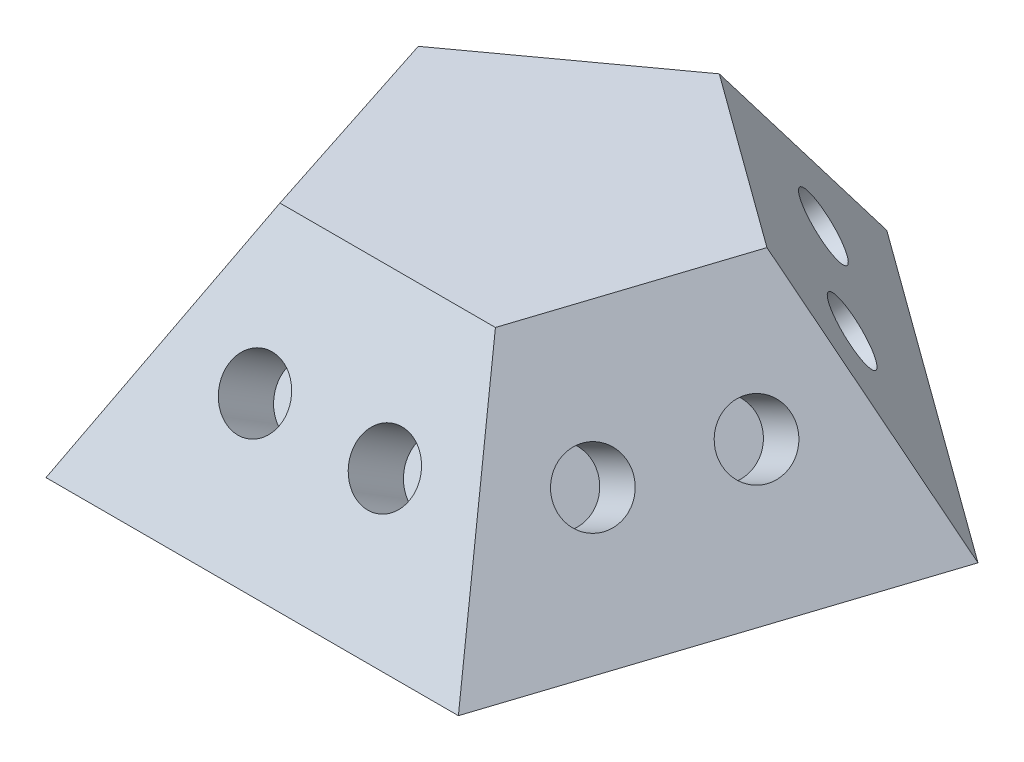
ISO-10303-21;
HEADER;
FILE_DESCRIPTION(('STEP AP214'),'2;1');
FILE_NAME('part.step','',(''),(''),'','','');
FILE_SCHEMA(('AUTOMOTIVE_DESIGN { 1 0 10303 214 1 1 1 1 }'));
ENDSEC;
DATA;
#1=APPLICATION_CONTEXT('core data for automotive mechanical design processes');
#2=APPLICATION_PROTOCOL_DEFINITION('international standard','automotive_design',2000,#1);
#3=PRODUCT_CONTEXT('',#1,'mechanical');
#4=PRODUCT('Part','Part','',(#3));
#5=PRODUCT_RELATED_PRODUCT_CATEGORY('part','',(#4));
#6=PRODUCT_DEFINITION_FORMATION('','',#4);
#7=PRODUCT_DEFINITION_CONTEXT('part definition',#1,'design');
#8=PRODUCT_DEFINITION('design','',#6,#7);
#9=PRODUCT_DEFINITION_SHAPE('','',#8);
#10=(LENGTH_UNIT() NAMED_UNIT(*) SI_UNIT(.MILLI.,.METRE.));
#11=(NAMED_UNIT(*) PLANE_ANGLE_UNIT() SI_UNIT($,.RADIAN.));
#12=(NAMED_UNIT(*) SI_UNIT($,.STERADIAN.) SOLID_ANGLE_UNIT());
#13=UNCERTAINTY_MEASURE_WITH_UNIT(LENGTH_MEASURE(1.E-05),#10,'distance_accuracy_value','');
#14=(GEOMETRIC_REPRESENTATION_CONTEXT(3) GLOBAL_UNCERTAINTY_ASSIGNED_CONTEXT((#13)) GLOBAL_UNIT_ASSIGNED_CONTEXT((#10,
#11,#12)) REPRESENTATION_CONTEXT('',''));
#15=CARTESIAN_POINT('',(0.,0.,0.));
#16=DIRECTION('',(0.,0.,1.));
#17=DIRECTION('',(1.,0.,0.));
#18=AXIS2_PLACEMENT_3D('',#15,#16,#17);
#19=CARTESIAN_POINT('',(10.2745158285618,0.,-3.33839256195651));
#20=DIRECTION('',(0.499999999999999,0.525731112119135,-0.688190960235587));
#21=DIRECTION('',(0.,0.794654472291766,0.607061998206687));
#22=AXIS2_PLACEMENT_3D('',#19,#20,#21);
#23=PLANE('',#22);
#24=CARTESIAN_POINT('',(5.52888070660527,3.37602039564716,-4.20724821160514));
#25=DIRECTION('',(0.500000000000004,0.525731112119135,-0.688190960235583));
#26=DIRECTION('',(0.309016994374952,-0.850650808352039,-0.425325404176018));
#27=AXIS2_PLACEMENT_3D('',#24,#25,#26);
#28=CIRCLE('',#27,1.);
#29=CARTESIAN_POINT('',(5.83789770098022,2.52536958729512,-4.63257361578116));
#30=VERTEX_POINT('',#29);
#31=EDGE_CURVE('E253',#30,#30,#28,.T.);
#32=ORIENTED_EDGE('',*,*,#31,.F.);
#33=EDGE_LOOP('',(#32));
#34=FACE_BOUND('',#33,.T.);
#35=CARTESIAN_POINT('',(2.2928127291055,3.37602039564715,-6.55838922077506));
#36=DIRECTION('',(0.500000000000004,0.525731112119135,-0.688190960235583));
#37=DIRECTION('',(0.309016994374952,-0.850650808352039,-0.425325404176018));
#38=AXIS2_PLACEMENT_3D('',#35,#36,#37);
#39=CIRCLE('',#38,1.);
#40=CARTESIAN_POINT('',(2.60182972348045,2.52536958729511,-6.98371462495108));
#41=VERTEX_POINT('',#40);
#42=EDGE_CURVE('E254',#41,#41,#39,.T.);
#43=ORIENTED_EDGE('',*,*,#42,.F.);
#44=EDGE_LOOP('',(#43));
#45=FACE_BOUND('',#44,.T.);
#46=DIRECTION('',(-0.809016994374948,0.,-0.587785252292472));
#47=VECTOR('',#46,1.);
#48=CARTESIAN_POINT('',(10.2745158285618,0.,-3.33839256195651));
#49=LINE('',#48,#47);
#50=CARTESIAN_POINT('',(10.2745158285618,0.,-3.33839256195651));
#51=VERTEX_POINT('',#50);
#52=CARTESIAN_POINT('',(0.,0.,-10.8032652660709));
#53=VERTEX_POINT('',#52);
#54=EDGE_CURVE('E85',#51,#53,#49,.T.);
#55=ORIENTED_EDGE('',*,*,#54,.T.);
#56=DIRECTION('',(0.,-0.794654472291765,-0.607061998206687));
#57=VECTOR('',#56,1.);
#58=CARTESIAN_POINT('',(0.,0.,-10.8032652660709));
#59=LINE('',#58,#57);
#60=CARTESIAN_POINT('',(0.,6.7520407912943,-5.64516508837352));
#61=VERTEX_POINT('',#60);
#62=EDGE_CURVE('E11',#61,#53,#59,.T.);
#63=ORIENTED_EDGE('',*,*,#62,.F.);
#64=DIRECTION('',(0.809016994374948,0.,0.587785252292472));
#65=VECTOR('',#64,1.);
#66=CARTESIAN_POINT('',(7.82169343571069,6.7520407912943,0.0376278336906518));
#67=LINE('',#66,#65);
#68=CARTESIAN_POINT('',(5.36887104285954,6.7520407912943,-1.74445194835958));
#69=VERTEX_POINT('',#68);
#70=EDGE_CURVE('E111',#69,#61,#67,.F.);
#71=ORIENTED_EDGE('',*,*,#70,.F.);
#72=DIRECTION('',(0.577350269189626,-0.794654472291765,-0.187592474085081));
#73=VECTOR('',#72,1.);
#74=CARTESIAN_POINT('',(10.2745158285618,0.,-3.33839256195651));
#75=LINE('',#74,#73);
#76=EDGE_CURVE('E97',#69,#51,#75,.T.);
#77=ORIENTED_EDGE('',*,*,#76,.T.);
#78=EDGE_LOOP('',(#55,#63,#71,#77));
#79=FACE_BOUND('',#78,.T.);
#80=ADVANCED_FACE('F33',(#34,#45,#79),#23,.T.);
#81=CARTESIAN_POINT('',(0.,0.,-10.8032652660709));
#82=DIRECTION('',(-0.500000000000001,0.525731112119135,-0.688190960235585));
#83=DIRECTION('',(0.,0.794654472291765,0.607061998206688));
#84=AXIS2_PLACEMENT_3D('',#81,#82,#83);
#85=PLANE('',#84);
#86=CARTESIAN_POINT('',(-5.52888070660523,3.37602039564715,-4.20724821160521));
#87=DIRECTION('',(-0.499999999999997,0.525731112119135,-0.688190960235588));
#88=DIRECTION('',(-0.309016994374946,-0.850650808352039,-0.425325404176023));
#89=AXIS2_PLACEMENT_3D('',#86,#87,#88);
#90=CIRCLE('',#89,1.);
#91=CARTESIAN_POINT('',(-5.83789770098017,2.52536958729511,-4.63257361578123));
#92=VERTEX_POINT('',#91);
#93=EDGE_CURVE('E263',#92,#92,#90,.T.);
#94=ORIENTED_EDGE('',*,*,#93,.F.);
#95=EDGE_LOOP('',(#94));
#96=FACE_BOUND('',#95,.T.);
#97=CARTESIAN_POINT('',(-2.29281272910543,3.37602039564716,-6.55838922077508));
#98=DIRECTION('',(-0.499999999999997,0.525731112119135,-0.688190960235588));
#99=DIRECTION('',(-0.309016994374946,-0.850650808352039,-0.425325404176023));
#100=AXIS2_PLACEMENT_3D('',#97,#98,#99);
#101=CIRCLE('',#100,1.);
#102=CARTESIAN_POINT('',(-2.60182972348037,2.52536958729512,-6.98371462495111));
#103=VERTEX_POINT('',#102);
#104=EDGE_CURVE('E262',#103,#103,#101,.T.);
#105=ORIENTED_EDGE('',*,*,#104,.F.);
#106=EDGE_LOOP('',(#105));
#107=FACE_BOUND('',#106,.T.);
#108=DIRECTION('',(-0.809016994374946,0.,0.587785252292474));
#109=VECTOR('',#108,1.);
#110=CARTESIAN_POINT('',(0.,0.,-10.8032652660709));
#111=LINE('',#110,#109);
#112=CARTESIAN_POINT('',(-10.2745158285618,0.,-3.33839256195648));
#113=VERTEX_POINT('',#112);
#114=EDGE_CURVE('E81',#53,#113,#111,.T.);
#115=ORIENTED_EDGE('',*,*,#114,.T.);
#116=DIRECTION('',(-0.577350269189627,-0.794654472291765,-0.187592474085079));
#117=VECTOR('',#116,1.);
#118=CARTESIAN_POINT('',(-10.2745158285618,0.,-3.33839256195648));
#119=LINE('',#118,#117);
#120=CARTESIAN_POINT('',(-5.36887104285954,6.7520407912943,-1.74445194835956));
#121=VERTEX_POINT('',#120);
#122=EDGE_CURVE('E42',#121,#113,#119,.T.);
#123=ORIENTED_EDGE('',*,*,#122,.F.);
#124=DIRECTION('',(0.809016994374946,0.,-0.587785252292474));
#125=VECTOR('',#124,1.);
#126=CARTESIAN_POINT('',(2.45282239285114,6.7520407912943,-7.42724487042375));
#127=LINE('',#126,#125);
#128=EDGE_CURVE('E93',#61,#121,#127,.F.);
#129=ORIENTED_EDGE('',*,*,#128,.F.);
#130=ORIENTED_EDGE('',*,*,#62,.T.);
#131=EDGE_LOOP('',(#115,#123,#129,#130));
#132=FACE_BOUND('',#131,.T.);
#133=ADVANCED_FACE('F35',(#96,#107,#132),#85,.T.);
#134=CARTESIAN_POINT('',(-10.2745158285618,0.,-3.33839256195648));
#135=DIRECTION('',(-0.809016994374947,0.525731112119135,0.262865556059568));
#136=DIRECTION('',(-0.544893675596393,-0.838505147446963,0.));
#137=AXIS2_PLACEMENT_3D('',#134,#135,#136);
#138=PLANE('',#137);
#139=CARTESIAN_POINT('',(-5.70984892553103,3.37602039564715,3.95816682689586));
#140=DIRECTION('',(-0.809016994374947,0.525731112119135,0.262865556059566));
#141=DIRECTION('',(-0.500000000000002,-0.850650808352039,0.162459848116452));
#142=AXIS2_PLACEMENT_3D('',#139,#140,#141);
#143=CIRCLE('',#142,1.);
#144=CARTESIAN_POINT('',(-6.20984892553104,2.52536958729511,4.12062667501231));
#145=VERTEX_POINT('',#144);
#146=EDGE_CURVE('E275',#145,#145,#143,.T.);
#147=ORIENTED_EDGE('',*,*,#146,.F.);
#148=EDGE_LOOP('',(#147));
#149=FACE_BOUND('',#148,.T.);
#150=CARTESIAN_POINT('',(-6.94591690303082,3.37602039564716,0.153940761715241));
#151=DIRECTION('',(-0.809016994374947,0.525731112119135,0.262865556059566));
#152=DIRECTION('',(-0.500000000000002,-0.850650808352039,0.162459848116452));
#153=AXIS2_PLACEMENT_3D('',#150,#151,#152);
#154=CIRCLE('',#153,1.);
#155=CARTESIAN_POINT('',(-7.44591690303082,2.52536958729512,0.316400609831693));
#156=VERTEX_POINT('',#155);
#157=EDGE_CURVE('E274',#156,#156,#154,.T.);
#158=ORIENTED_EDGE('',*,*,#157,.F.);
#159=EDGE_LOOP('',(#158));
#160=FACE_BOUND('',#159,.T.);
#161=DIRECTION('',(0.309016994374949,0.,0.951056516295153));
#162=VECTOR('',#161,1.);
#163=CARTESIAN_POINT('',(-10.2745158285618,0.,-3.33839256195648));
#164=LINE('',#163,#162);
#165=CARTESIAN_POINT('',(-6.34999999999999,0.,8.74002519499197));
#166=VERTEX_POINT('',#165);
#167=EDGE_CURVE('E87',#113,#166,#164,.T.);
#168=ORIENTED_EDGE('',*,*,#167,.T.);
#169=DIRECTION('',(-0.35682208977309,-0.794654472291765,0.491123473188424));
#170=VECTOR('',#169,1.);
#171=CARTESIAN_POINT('',(-6.34999999999999,0.,8.74002519499197));
#172=LINE('',#171,#170);
#173=CARTESIAN_POINT('',(-3.31814478570228,6.7520407912943,4.56703449254634));
#174=VERTEX_POINT('',#173);
#175=EDGE_CURVE('E117',#174,#166,#172,.T.);
#176=ORIENTED_EDGE('',*,*,#175,.F.);
#177=DIRECTION('',(-0.309016994374949,0.,-0.951056516295153));
#178=VECTOR('',#177,1.);
#179=CARTESIAN_POINT('',(-6.30576582856184,6.7520407912943,-4.62791760638084));
#180=LINE('',#179,#178);
#181=EDGE_CURVE('E123',#121,#174,#180,.F.);
#182=ORIENTED_EDGE('',*,*,#181,.F.);
#183=ORIENTED_EDGE('',*,*,#122,.T.);
#184=EDGE_LOOP('',(#168,#176,#182,#183));
#185=FACE_BOUND('',#184,.T.);
#186=ADVANCED_FACE('F128',(#149,#160,#185),#138,.T.);
#187=CARTESIAN_POINT('',(-6.34999999999999,0.,8.74002519499197));
#188=DIRECTION('',(0.,0.525731112119135,0.850650808352039));
#189=DIRECTION('',(0.,-0.850650808352039,0.525731112119135));
#190=AXIS2_PLACEMENT_3D('',#187,#188,#189);
#191=PLANE('',#190);
#192=CARTESIAN_POINT('',(-1.99999999999999,3.37602039564716,6.65352984376915));
#193=DIRECTION('',(0.,0.525731112119135,0.850650808352039));
#194=DIRECTION('',(0.,-0.850650808352039,0.525731112119135));
#195=AXIS2_PLACEMENT_3D('',#192,#193,#194);
#196=CIRCLE('',#195,1.);
#197=CARTESIAN_POINT('',(-1.99999999999999,2.52536958729512,7.17926095588829));
#198=VERTEX_POINT('',#197);
#199=EDGE_CURVE('E101',#198,#198,#196,.T.);
#200=ORIENTED_EDGE('',*,*,#199,.F.);
#201=EDGE_LOOP('',(#200));
#202=FACE_BOUND('',#201,.T.);
#203=CARTESIAN_POINT('',(2.00000000000001,3.37602039564715,6.65352984376915));
#204=DIRECTION('',(0.,0.525731112119135,0.850650808352039));
#205=DIRECTION('',(0.,-0.850650808352039,0.525731112119135));
#206=AXIS2_PLACEMENT_3D('',#203,#204,#205);
#207=CIRCLE('',#206,1.);
#208=CARTESIAN_POINT('',(2.00000000000001,2.52536958729511,7.17926095588828));
#209=VERTEX_POINT('',#208);
#210=EDGE_CURVE('E104',#209,#209,#207,.T.);
#211=ORIENTED_EDGE('',*,*,#210,.F.);
#212=EDGE_LOOP('',(#211));
#213=FACE_BOUND('',#212,.T.);
#214=DIRECTION('',(1.,0.,0.));
#215=VECTOR('',#214,1.);
#216=CARTESIAN_POINT('',(-6.34999999999999,0.,8.74002519499197));
#217=LINE('',#216,#215);
#218=CARTESIAN_POINT('',(6.35000000000002,0.,8.74002519499195));
#219=VERTEX_POINT('',#218);
#220=EDGE_CURVE('E108',#166,#219,#217,.T.);
#221=ORIENTED_EDGE('',*,*,#220,.T.);
#222=DIRECTION('',(0.356822089773091,-0.794654472291765,0.491123473188423));
#223=VECTOR('',#222,1.);
#224=CARTESIAN_POINT('',(6.35000000000002,0.,8.74002519499195));
#225=LINE('',#224,#223);
#226=CARTESIAN_POINT('',(3.3181447857023,6.7520407912943,4.56703449254632));
#227=VERTEX_POINT('',#226);
#228=EDGE_CURVE('E114',#227,#219,#225,.T.);
#229=ORIENTED_EDGE('',*,*,#228,.F.);
#230=DIRECTION('',(-1.,0.,0.));
#231=VECTOR('',#230,1.);
#232=CARTESIAN_POINT('',(-6.34999999999999,6.7520407912943,4.56703449254634));
#233=LINE('',#232,#231);
#234=EDGE_CURVE('E54',#174,#227,#233,.F.);
#235=ORIENTED_EDGE('',*,*,#234,.F.);
#236=ORIENTED_EDGE('',*,*,#175,.T.);
#237=EDGE_LOOP('',(#221,#229,#235,#236));
#238=FACE_BOUND('',#237,.T.);
#239=ADVANCED_FACE('F130',(#202,#213,#238),#191,.T.);
#240=CARTESIAN_POINT('',(6.35000000000002,0.,8.74002519499195));
#241=DIRECTION('',(0.809016994374947,0.525731112119135,0.262865556059565));
#242=DIRECTION('',(-0.544893675596392,0.838505147446963,0.));
#243=AXIS2_PLACEMENT_3D('',#240,#241,#242);
#244=PLANE('',#243);
#245=CARTESIAN_POINT('',(6.94591690303082,3.37602039564715,0.153940761715315));
#246=DIRECTION('',(0.809016994374944,0.525731112119135,0.262865556059574));
#247=DIRECTION('',(0.499999999999999,-0.850650808352039,0.162459848116459));
#248=AXIS2_PLACEMENT_3D('',#245,#246,#247);
#249=CIRCLE('',#248,1.);
#250=CARTESIAN_POINT('',(7.44591690303082,2.52536958729511,0.316400609831774));
#251=VERTEX_POINT('',#250);
#252=EDGE_CURVE('E242',#251,#251,#249,.T.);
#253=ORIENTED_EDGE('',*,*,#252,.F.);
#254=EDGE_LOOP('',(#253));
#255=FACE_BOUND('',#254,.T.);
#256=CARTESIAN_POINT('',(5.70984892553099,3.37602039564716,3.95816682689592));
#257=DIRECTION('',(0.809016994374944,0.525731112119135,0.262865556059574));
#258=DIRECTION('',(0.499999999999999,-0.850650808352039,0.162459848116459));
#259=AXIS2_PLACEMENT_3D('',#256,#257,#258);
#260=CIRCLE('',#259,1.);
#261=CARTESIAN_POINT('',(6.20984892553099,2.52536958729512,4.12062667501238));
#262=VERTEX_POINT('',#261);
#263=EDGE_CURVE('E241',#262,#262,#260,.T.);
#264=ORIENTED_EDGE('',*,*,#263,.F.);
#265=EDGE_LOOP('',(#264));
#266=FACE_BOUND('',#265,.T.);
#267=DIRECTION('',(0.309016994374946,0.,-0.951056516295154));
#268=VECTOR('',#267,1.);
#269=CARTESIAN_POINT('',(6.35000000000002,0.,8.74002519499195));
#270=LINE('',#269,#268);
#271=EDGE_CURVE('E110',#219,#51,#270,.T.);
#272=ORIENTED_EDGE('',*,*,#271,.T.);
#273=ORIENTED_EDGE('',*,*,#76,.F.);
#274=DIRECTION('',(-0.309016994374946,0.,0.951056516295154));
#275=VECTOR('',#274,1.);
#276=CARTESIAN_POINT('',(2.38125000000001,6.7520407912943,7.4505001505676));
#277=LINE('',#276,#275);
#278=EDGE_CURVE('E37',#227,#69,#277,.F.);
#279=ORIENTED_EDGE('',*,*,#278,.F.);
#280=ORIENTED_EDGE('',*,*,#228,.T.);
#281=EDGE_LOOP('',(#272,#273,#279,#280));
#282=FACE_BOUND('',#281,.T.);
#283=ADVANCED_FACE('F132',(#255,#266,#282),#244,.T.);
#284=CARTESIAN_POINT('',(0.,6.7520407912943,0.));
#285=DIRECTION('',(0.,1.,0.));
#286=DIRECTION('',(0.,0.,1.));
#287=AXIS2_PLACEMENT_3D('',#284,#285,#286);
#288=PLANE('',#287);
#289=ORIENTED_EDGE('',*,*,#70,.T.);
#290=ORIENTED_EDGE('',*,*,#128,.T.);
#291=ORIENTED_EDGE('',*,*,#181,.T.);
#292=ORIENTED_EDGE('',*,*,#234,.T.);
#293=ORIENTED_EDGE('',*,*,#278,.T.);
#294=EDGE_LOOP('',(#289,#290,#291,#292,#293));
#295=FACE_BOUND('',#294,.T.);
#296=ADVANCED_FACE('F126',(#295),#288,.T.);
#297=CARTESIAN_POINT('',(0.,0.,0.));
#298=DIRECTION('',(0.,1.,0.));
#299=DIRECTION('',(0.,0.,1.));
#300=AXIS2_PLACEMENT_3D('',#297,#298,#299);
#301=PLANE('',#300);
#302=ORIENTED_EDGE('',*,*,#54,.F.);
#303=ORIENTED_EDGE('',*,*,#271,.F.);
#304=ORIENTED_EDGE('',*,*,#220,.F.);
#305=ORIENTED_EDGE('',*,*,#167,.F.);
#306=ORIENTED_EDGE('',*,*,#114,.F.);
#307=EDGE_LOOP('',(#302,#303,#304,#305,#306));
#308=FACE_BOUND('',#307,.T.);
#309=ADVANCED_FACE('F82',(#308),#301,.F.);
#310=CARTESIAN_POINT('',(2.00000000000001,2.32455817140888,4.95222822706507));
#311=DIRECTION('',(0.,0.525731112119135,0.850650808352039));
#312=DIRECTION('',(0.,-0.850650808352039,0.525731112119135));
#313=AXIS2_PLACEMENT_3D('',#310,#311,#312);
#314=CYLINDRICAL_SURFACE('',#313,1.);
#315=CARTESIAN_POINT('',(2.00000000000001,2.32455817140888,4.95222822706507));
#316=DIRECTION('',(0.,0.525731112119135,0.850650808352039));
#317=DIRECTION('',(0.,-0.850650808352039,0.525731112119135));
#318=AXIS2_PLACEMENT_3D('',#315,#316,#317);
#319=CIRCLE('',#318,1.);
#320=CARTESIAN_POINT('',(2.00000000000001,1.47390736305684,5.4779593391842));
#321=VERTEX_POINT('',#320);
#322=EDGE_CURVE('E289',#321,#321,#319,.T.);
#323=ORIENTED_EDGE('',*,*,#322,.F.);
#324=EDGE_LOOP('',(#323));
#325=FACE_BOUND('',#324,.T.);
#326=ORIENTED_EDGE('',*,*,#210,.T.);
#327=EDGE_LOOP('',(#326));
#328=FACE_BOUND('',#327,.T.);
#329=ADVANCED_FACE('F156',(#325,#328),#314,.F.);
#330=CARTESIAN_POINT('',(2.00000000000001,2.32455817140888,4.95222822706507));
#331=DIRECTION('',(0.,0.525731112119135,0.850650808352039));
#332=DIRECTION('',(0.,-0.850650808352039,0.525731112119135));
#333=AXIS2_PLACEMENT_3D('',#330,#331,#332);
#334=PLANE('',#333);
#335=ORIENTED_EDGE('',*,*,#322,.T.);
#336=EDGE_LOOP('',(#335));
#337=FACE_BOUND('',#336,.T.);
#338=ADVANCED_FACE('F160',(#337),#334,.T.);
#339=CARTESIAN_POINT('',(-1.99999999999999,2.32455817140889,4.95222822706507));
#340=DIRECTION('',(0.,0.525731112119135,0.850650808352039));
#341=DIRECTION('',(0.,-0.850650808352039,0.525731112119135));
#342=AXIS2_PLACEMENT_3D('',#339,#340,#341);
#343=CYLINDRICAL_SURFACE('',#342,1.);
#344=CARTESIAN_POINT('',(-1.99999999999999,2.32455817140889,4.95222822706507));
#345=DIRECTION('',(0.,0.525731112119135,0.850650808352039));
#346=DIRECTION('',(0.,-0.850650808352039,0.525731112119135));
#347=AXIS2_PLACEMENT_3D('',#344,#345,#346);
#348=CIRCLE('',#347,1.);
#349=CARTESIAN_POINT('',(-1.99999999999999,1.47390736305685,5.47795933918421));
#350=VERTEX_POINT('',#349);
#351=EDGE_CURVE('E98',#350,#350,#348,.T.);
#352=ORIENTED_EDGE('',*,*,#351,.F.);
#353=EDGE_LOOP('',(#352));
#354=FACE_BOUND('',#353,.T.);
#355=ORIENTED_EDGE('',*,*,#199,.T.);
#356=EDGE_LOOP('',(#355));
#357=FACE_BOUND('',#356,.T.);
#358=ADVANCED_FACE('F164',(#354,#357),#343,.F.);
#359=CARTESIAN_POINT('',(-1.99999999999999,2.32455817140889,4.95222822706507));
#360=DIRECTION('',(0.,0.525731112119135,0.850650808352039));
#361=DIRECTION('',(0.,-0.850650808352039,0.525731112119135));
#362=AXIS2_PLACEMENT_3D('',#359,#360,#361);
#363=PLANE('',#362);
#364=ORIENTED_EDGE('',*,*,#351,.T.);
#365=EDGE_LOOP('',(#364));
#366=FACE_BOUND('',#365,.T.);
#367=ADVANCED_FACE('F168',(#366),#363,.T.);
#368=CARTESIAN_POINT('',(4.0918149367811,2.32455817140889,3.43243571477677));
#369=DIRECTION('',(0.809016994374944,0.525731112119135,0.262865556059574));
#370=DIRECTION('',(-0.544893675596394,0.838505147446962,0.));
#371=AXIS2_PLACEMENT_3D('',#368,#369,#370);
#372=CYLINDRICAL_SURFACE('',#371,1.);
#373=CARTESIAN_POINT('',(4.0918149367811,2.32455817140889,3.43243571477677));
#374=DIRECTION('',(0.809016994374944,0.525731112119135,0.262865556059574));
#375=DIRECTION('',(0.499999999999999,-0.850650808352039,0.162459848116459));
#376=AXIS2_PLACEMENT_3D('',#373,#374,#375);
#377=CIRCLE('',#376,1.);
#378=CARTESIAN_POINT('',(4.5918149367811,1.47390736305685,3.59489556289323));
#379=VERTEX_POINT('',#378);
#380=EDGE_CURVE('E245',#379,#379,#377,.T.);
#381=ORIENTED_EDGE('',*,*,#380,.F.);
#382=EDGE_LOOP('',(#381));
#383=FACE_BOUND('',#382,.T.);
#384=ORIENTED_EDGE('',*,*,#263,.T.);
#385=EDGE_LOOP('',(#384));
#386=FACE_BOUND('',#385,.T.);
#387=ADVANCED_FACE('F172',(#383,#386),#372,.F.);
#388=CARTESIAN_POINT('',(4.0918149367811,2.32455817140889,3.43243571477677));
#389=DIRECTION('',(0.809016994374944,0.525731112119135,0.262865556059574));
#390=DIRECTION('',(0.499999999999999,-0.850650808352039,0.162459848116459));
#391=AXIS2_PLACEMENT_3D('',#388,#389,#390);
#392=PLANE('',#391);
#393=ORIENTED_EDGE('',*,*,#380,.T.);
#394=EDGE_LOOP('',(#393));
#395=FACE_BOUND('',#394,.T.);
#396=ADVANCED_FACE('F219',(#395),#392,.T.);
#397=CARTESIAN_POINT('',(5.32788291428093,2.32455817140888,-0.371790350403834));
#398=DIRECTION('',(0.809016994374944,0.525731112119135,0.262865556059574));
#399=DIRECTION('',(-0.544893675596394,0.838505147446962,0.));
#400=AXIS2_PLACEMENT_3D('',#397,#398,#399);
#401=CYLINDRICAL_SURFACE('',#400,1.);
#402=CARTESIAN_POINT('',(5.32788291428093,2.32455817140888,-0.371790350403834));
#403=DIRECTION('',(0.809016994374944,0.525731112119135,0.262865556059574));
#404=DIRECTION('',(0.499999999999999,-0.850650808352039,0.162459848116459));
#405=AXIS2_PLACEMENT_3D('',#402,#403,#404);
#406=CIRCLE('',#405,1.);
#407=CARTESIAN_POINT('',(5.82788291428093,1.47390736305684,-0.209330502287375));
#408=VERTEX_POINT('',#407);
#409=EDGE_CURVE('E240',#408,#408,#406,.T.);
#410=ORIENTED_EDGE('',*,*,#409,.F.);
#411=EDGE_LOOP('',(#410));
#412=FACE_BOUND('',#411,.T.);
#413=ORIENTED_EDGE('',*,*,#252,.T.);
#414=EDGE_LOOP('',(#413));
#415=FACE_BOUND('',#414,.T.);
#416=ADVANCED_FACE('F223',(#412,#415),#401,.F.);
#417=CARTESIAN_POINT('',(5.32788291428093,2.32455817140888,-0.371790350403834));
#418=DIRECTION('',(0.809016994374944,0.525731112119135,0.262865556059574));
#419=DIRECTION('',(0.499999999999999,-0.850650808352039,0.162459848116459));
#420=AXIS2_PLACEMENT_3D('',#417,#418,#419);
#421=PLANE('',#420);
#422=ORIENTED_EDGE('',*,*,#409,.T.);
#423=EDGE_LOOP('',(#422));
#424=FACE_BOUND('',#423,.T.);
#425=ADVANCED_FACE('F178',(#424),#421,.T.);
#426=CARTESIAN_POINT('',(-5.32788291428092,2.32455817140889,-0.371790350403891));
#427=DIRECTION('',(-0.809016994374947,0.525731112119135,0.262865556059566));
#428=DIRECTION('',(-0.544893675596393,-0.838505147446963,0.));
#429=AXIS2_PLACEMENT_3D('',#426,#427,#428);
#430=CYLINDRICAL_SURFACE('',#429,1.);
#431=CARTESIAN_POINT('',(-5.32788291428092,2.32455817140889,-0.371790350403891));
#432=DIRECTION('',(-0.809016994374947,0.525731112119135,0.262865556059566));
#433=DIRECTION('',(-0.500000000000002,-0.850650808352039,0.162459848116452));
#434=AXIS2_PLACEMENT_3D('',#431,#432,#433);
#435=CIRCLE('',#434,1.);
#436=CARTESIAN_POINT('',(-5.82788291428093,1.47390736305685,-0.209330502287439));
#437=VERTEX_POINT('',#436);
#438=EDGE_CURVE('E283',#437,#437,#435,.T.);
#439=ORIENTED_EDGE('',*,*,#438,.F.);
#440=EDGE_LOOP('',(#439));
#441=FACE_BOUND('',#440,.T.);
#442=ORIENTED_EDGE('',*,*,#157,.T.);
#443=EDGE_LOOP('',(#442));
#444=FACE_BOUND('',#443,.T.);
#445=ADVANCED_FACE('F174',(#441,#444),#430,.F.);
#446=CARTESIAN_POINT('',(-5.32788291428092,2.32455817140889,-0.371790350403891));
#447=DIRECTION('',(-0.809016994374947,0.525731112119135,0.262865556059566));
#448=DIRECTION('',(-0.500000000000002,-0.850650808352039,0.162459848116452));
#449=AXIS2_PLACEMENT_3D('',#446,#447,#448);
#450=PLANE('',#449);
#451=ORIENTED_EDGE('',*,*,#438,.T.);
#452=EDGE_LOOP('',(#451));
#453=FACE_BOUND('',#452,.T.);
#454=ADVANCED_FACE('F177',(#453),#450,.T.);
#455=CARTESIAN_POINT('',(-4.09181493678114,2.32455817140888,3.43243571477673));
#456=DIRECTION('',(-0.809016994374947,0.525731112119135,0.262865556059566));
#457=DIRECTION('',(-0.544893675596393,-0.838505147446963,0.));
#458=AXIS2_PLACEMENT_3D('',#455,#456,#457);
#459=CYLINDRICAL_SURFACE('',#458,1.);
#460=CARTESIAN_POINT('',(-4.09181493678114,2.32455817140888,3.43243571477673));
#461=DIRECTION('',(-0.809016994374947,0.525731112119135,0.262865556059566));
#462=DIRECTION('',(-0.500000000000002,-0.850650808352039,0.162459848116452));
#463=AXIS2_PLACEMENT_3D('',#460,#461,#462);
#464=CIRCLE('',#463,1.);
#465=CARTESIAN_POINT('',(-4.59181493678114,1.47390736305684,3.59489556289318));
#466=VERTEX_POINT('',#465);
#467=EDGE_CURVE('E271',#466,#466,#464,.T.);
#468=ORIENTED_EDGE('',*,*,#467,.F.);
#469=EDGE_LOOP('',(#468));
#470=FACE_BOUND('',#469,.T.);
#471=ORIENTED_EDGE('',*,*,#146,.T.);
#472=EDGE_LOOP('',(#471));
#473=FACE_BOUND('',#472,.T.);
#474=ADVANCED_FACE('F182',(#470,#473),#459,.F.);
#475=CARTESIAN_POINT('',(-4.09181493678114,2.32455817140888,3.43243571477673));
#476=DIRECTION('',(-0.809016994374947,0.525731112119135,0.262865556059566));
#477=DIRECTION('',(-0.500000000000002,-0.850650808352039,0.162459848116452));
#478=AXIS2_PLACEMENT_3D('',#475,#476,#477);
#479=PLANE('',#478);
#480=ORIENTED_EDGE('',*,*,#467,.T.);
#481=EDGE_LOOP('',(#480));
#482=FACE_BOUND('',#481,.T.);
#483=ADVANCED_FACE('F188',(#482),#479,.T.);
#484=CARTESIAN_POINT('',(-1.29281272910543,2.32455817140889,-5.18200730030391));
#485=DIRECTION('',(-0.499999999999997,0.525731112119135,-0.688190960235588));
#486=DIRECTION('',(0.,0.794654472291766,0.607061998206686));
#487=AXIS2_PLACEMENT_3D('',#484,#485,#486);
#488=CYLINDRICAL_SURFACE('',#487,1.);
#489=CARTESIAN_POINT('',(-1.29281272910543,2.32455817140889,-5.18200730030391));
#490=DIRECTION('',(-0.499999999999997,0.525731112119135,-0.688190960235588));
#491=DIRECTION('',(-0.309016994374946,-0.850650808352039,-0.425325404176023));
#492=AXIS2_PLACEMENT_3D('',#489,#490,#491);
#493=CIRCLE('',#492,1.);
#494=CARTESIAN_POINT('',(-1.60182972348038,1.47390736305685,-5.60733270447993));
#495=VERTEX_POINT('',#494);
#496=EDGE_CURVE('E278',#495,#495,#493,.T.);
#497=ORIENTED_EDGE('',*,*,#496,.F.);
#498=EDGE_LOOP('',(#497));
#499=FACE_BOUND('',#498,.T.);
#500=ORIENTED_EDGE('',*,*,#104,.T.);
#501=EDGE_LOOP('',(#500));
#502=FACE_BOUND('',#501,.T.);
#503=ADVANCED_FACE('F184',(#499,#502),#488,.F.);
#504=CARTESIAN_POINT('',(-1.29281272910543,2.32455817140889,-5.18200730030391));
#505=DIRECTION('',(-0.499999999999997,0.525731112119135,-0.688190960235588));
#506=DIRECTION('',(-0.309016994374946,-0.850650808352039,-0.425325404176023));
#507=AXIS2_PLACEMENT_3D('',#504,#505,#506);
#508=PLANE('',#507);
#509=ORIENTED_EDGE('',*,*,#496,.T.);
#510=EDGE_LOOP('',(#509));
#511=FACE_BOUND('',#510,.T.);
#512=ADVANCED_FACE('F187',(#511),#508,.T.);
#513=CARTESIAN_POINT('',(-4.52888070660523,2.32455817140888,-2.83086629113403));
#514=DIRECTION('',(-0.499999999999997,0.525731112119135,-0.688190960235588));
#515=DIRECTION('',(0.,0.794654472291766,0.607061998206686));
#516=AXIS2_PLACEMENT_3D('',#513,#514,#515);
#517=CYLINDRICAL_SURFACE('',#516,1.);
#518=CARTESIAN_POINT('',(-4.52888070660523,2.32455817140888,-2.83086629113403));
#519=DIRECTION('',(-0.499999999999997,0.525731112119135,-0.688190960235588));
#520=DIRECTION('',(-0.309016994374946,-0.850650808352039,-0.425325404176023));
#521=AXIS2_PLACEMENT_3D('',#518,#519,#520);
#522=CIRCLE('',#521,1.);
#523=CARTESIAN_POINT('',(-4.83789770098018,1.47390736305684,-3.25619169531005));
#524=VERTEX_POINT('',#523);
#525=EDGE_CURVE('E259',#524,#524,#522,.T.);
#526=ORIENTED_EDGE('',*,*,#525,.F.);
#527=EDGE_LOOP('',(#526));
#528=FACE_BOUND('',#527,.T.);
#529=ORIENTED_EDGE('',*,*,#93,.T.);
#530=EDGE_LOOP('',(#529));
#531=FACE_BOUND('',#530,.T.);
#532=ADVANCED_FACE('F192',(#528,#531),#517,.F.);
#533=CARTESIAN_POINT('',(-4.52888070660523,2.32455817140888,-2.83086629113403));
#534=DIRECTION('',(-0.499999999999997,0.525731112119135,-0.688190960235588));
#535=DIRECTION('',(-0.309016994374946,-0.850650808352039,-0.425325404176023));
#536=AXIS2_PLACEMENT_3D('',#533,#534,#535);
#537=PLANE('',#536);
#538=ORIENTED_EDGE('',*,*,#525,.T.);
#539=EDGE_LOOP('',(#538));
#540=FACE_BOUND('',#539,.T.);
#541=ADVANCED_FACE('F211',(#540),#537,.T.);
#542=CARTESIAN_POINT('',(1.29281272910549,2.32455817140888,-5.18200730030389));
#543=DIRECTION('',(0.500000000000004,0.525731112119135,-0.688190960235583));
#544=DIRECTION('',(0.,0.794654472291764,0.607061998206689));
#545=AXIS2_PLACEMENT_3D('',#542,#543,#544);
#546=CYLINDRICAL_SURFACE('',#545,1.);
#547=CARTESIAN_POINT('',(1.29281272910549,2.32455817140888,-5.18200730030389));
#548=DIRECTION('',(0.500000000000004,0.525731112119135,-0.688190960235583));
#549=DIRECTION('',(0.309016994374952,-0.850650808352039,-0.425325404176018));
#550=AXIS2_PLACEMENT_3D('',#547,#548,#549);
#551=CIRCLE('',#550,1.);
#552=CARTESIAN_POINT('',(1.60182972348044,1.47390736305684,-5.60733270447991));
#553=VERTEX_POINT('',#552);
#554=EDGE_CURVE('E250',#553,#553,#551,.T.);
#555=ORIENTED_EDGE('',*,*,#554,.F.);
#556=EDGE_LOOP('',(#555));
#557=FACE_BOUND('',#556,.T.);
#558=ORIENTED_EDGE('',*,*,#42,.T.);
#559=EDGE_LOOP('',(#558));
#560=FACE_BOUND('',#559,.T.);
#561=ADVANCED_FACE('F215',(#557,#560),#546,.F.);
#562=CARTESIAN_POINT('',(1.29281272910549,2.32455817140888,-5.18200730030389));
#563=DIRECTION('',(0.500000000000004,0.525731112119135,-0.688190960235583));
#564=DIRECTION('',(0.309016994374952,-0.850650808352039,-0.425325404176018));
#565=AXIS2_PLACEMENT_3D('',#562,#563,#564);
#566=PLANE('',#565);
#567=ORIENTED_EDGE('',*,*,#554,.T.);
#568=EDGE_LOOP('',(#567));
#569=FACE_BOUND('',#568,.T.);
#570=ADVANCED_FACE('F204',(#569),#566,.T.);
#571=CARTESIAN_POINT('',(4.52888070660526,2.32455817140889,-2.83086629113398));
#572=DIRECTION('',(0.500000000000004,0.525731112119135,-0.688190960235583));
#573=DIRECTION('',(0.,0.794654472291764,0.607061998206689));
#574=AXIS2_PLACEMENT_3D('',#571,#572,#573);
#575=CYLINDRICAL_SURFACE('',#574,1.);
#576=CARTESIAN_POINT('',(4.52888070660526,2.32455817140889,-2.83086629113398));
#577=DIRECTION('',(0.500000000000004,0.525731112119135,-0.688190960235583));
#578=DIRECTION('',(0.309016994374952,-0.850650808352039,-0.425325404176018));
#579=AXIS2_PLACEMENT_3D('',#576,#577,#578);
#580=CIRCLE('',#579,1.);
#581=CARTESIAN_POINT('',(4.83789770098021,1.47390736305685,-3.25619169531));
#582=VERTEX_POINT('',#581);
#583=EDGE_CURVE('E266',#582,#582,#580,.T.);
#584=ORIENTED_EDGE('',*,*,#583,.F.);
#585=EDGE_LOOP('',(#584));
#586=FACE_BOUND('',#585,.T.);
#587=ORIENTED_EDGE('',*,*,#31,.T.);
#588=EDGE_LOOP('',(#587));
#589=FACE_BOUND('',#588,.T.);
#590=ADVANCED_FACE('F200',(#586,#589),#575,.F.);
#591=CARTESIAN_POINT('',(4.52888070660526,2.32455817140889,-2.83086629113398));
#592=DIRECTION('',(0.500000000000004,0.525731112119135,-0.688190960235583));
#593=DIRECTION('',(0.309016994374952,-0.850650808352039,-0.425325404176018));
#594=AXIS2_PLACEMENT_3D('',#591,#592,#593);
#595=PLANE('',#594);
#596=ORIENTED_EDGE('',*,*,#583,.T.);
#597=EDGE_LOOP('',(#596));
#598=FACE_BOUND('',#597,.T.);
#599=ADVANCED_FACE('F203',(#598),#595,.T.);
#600=CLOSED_SHELL('',(#80,#133,#186,#239,#283,#296,#309,#329,#338,#358,#367,#387,#396,#416,#425,
#445,#454,#474,#483,#503,#512,#532,#541,#561,#570,#590,#599));
#601=MANIFOLD_SOLID_BREP('B2',#600);
#602=ADVANCED_BREP_SHAPE_REPRESENTATION('',(#18,#601),#14);
#603=SHAPE_DEFINITION_REPRESENTATION(#9,#602);
ENDSEC;
END-ISO-10303-21;
